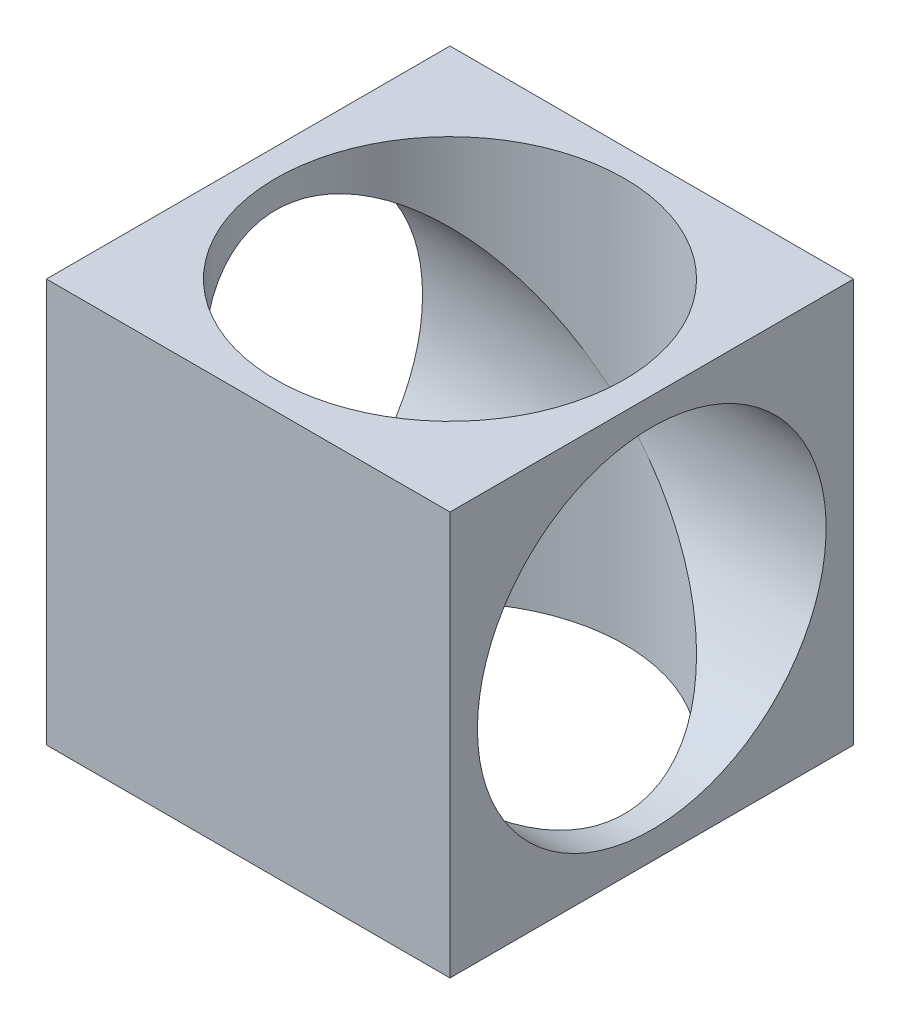
ISO-10303-21;
HEADER;
FILE_DESCRIPTION(('STEP AP214'),'2;1');
FILE_NAME('part.step','',(''),(''),'','','');
FILE_SCHEMA(('AUTOMOTIVE_DESIGN { 1 0 10303 214 1 1 1 1 }'));
ENDSEC;
DATA;
#1=APPLICATION_CONTEXT('core data for automotive mechanical design processes');
#2=APPLICATION_PROTOCOL_DEFINITION('international standard','automotive_design',2000,#1);
#3=PRODUCT_CONTEXT('',#1,'mechanical');
#4=PRODUCT('Part','Part','',(#3));
#5=PRODUCT_RELATED_PRODUCT_CATEGORY('part','',(#4));
#6=PRODUCT_DEFINITION_FORMATION('','',#4);
#7=PRODUCT_DEFINITION_CONTEXT('part definition',#1,'design');
#8=PRODUCT_DEFINITION('design','',#6,#7);
#9=PRODUCT_DEFINITION_SHAPE('','',#8);
#10=(LENGTH_UNIT() NAMED_UNIT(*) SI_UNIT(.MILLI.,.METRE.));
#11=(NAMED_UNIT(*) PLANE_ANGLE_UNIT() SI_UNIT($,.RADIAN.));
#12=(NAMED_UNIT(*) SI_UNIT($,.STERADIAN.) SOLID_ANGLE_UNIT());
#13=UNCERTAINTY_MEASURE_WITH_UNIT(LENGTH_MEASURE(1.E-05),#10,'distance_accuracy_value','');
#14=(GEOMETRIC_REPRESENTATION_CONTEXT(3) GLOBAL_UNCERTAINTY_ASSIGNED_CONTEXT((#13)) GLOBAL_UNIT_ASSIGNED_CONTEXT((#10,
#11,#12)) REPRESENTATION_CONTEXT('',''));
#15=CARTESIAN_POINT('',(0.,0.,0.));
#16=DIRECTION('',(0.,0.,1.));
#17=DIRECTION('',(1.,0.,0.));
#18=AXIS2_PLACEMENT_3D('',#15,#16,#17);
#19=CARTESIAN_POINT('',(0.,0.,0.));
#20=DIRECTION('',(0.,1.,0.));
#21=DIRECTION('',(0.,0.,1.));
#22=AXIS2_PLACEMENT_3D('',#19,#20,#21);
#23=CYLINDRICAL_SURFACE('',#22,13.716);
#24=CARTESIAN_POINT('',(0.,31.75,0.));
#25=DIRECTION('',(0.,-1.,0.));
#26=DIRECTION('',(0.,0.,-1.));
#27=AXIS2_PLACEMENT_3D('',#24,#25,#26);
#28=CIRCLE('',#27,13.716);
#29=CARTESIAN_POINT('',(0.,31.75,-13.716));
#30=VERTEX_POINT('',#29);
#31=EDGE_CURVE('E137',#30,#30,#28,.T.);
#32=ORIENTED_EDGE('',*,*,#31,.F.);
#33=EDGE_LOOP('',(#32));
#34=FACE_BOUND('',#33,.T.);
#35=CARTESIAN_POINT('',(0.,15.875,0.));
#36=DIRECTION('',(0.707106781186547,0.707106781186547,0.));
#37=DIRECTION('',(-0.707106781186547,0.707106781186547,0.));
#38=AXIS2_PLACEMENT_3D('',#35,#36,#37);
#39=ELLIPSE('',#38,19.3973532215094,13.716);
#40=CARTESIAN_POINT('',(0.,15.875,13.716));
#41=VERTEX_POINT('',#40);
#42=CARTESIAN_POINT('',(0.,15.875,-13.716));
#43=VERTEX_POINT('',#42);
#44=EDGE_CURVE('E52',#41,#43,#39,.F.);
#45=ORIENTED_EDGE('',*,*,#44,.T.);
#46=CARTESIAN_POINT('',(0.,15.875,0.));
#47=DIRECTION('',(-0.707106781186547,0.707106781186547,0.));
#48=DIRECTION('',(0.707106781186547,0.707106781186547,0.));
#49=AXIS2_PLACEMENT_3D('',#46,#47,#48);
#50=ELLIPSE('',#49,19.3973532215094,13.716);
#51=EDGE_CURVE('E11',#43,#41,#50,.F.);
#52=ORIENTED_EDGE('',*,*,#51,.T.);
#53=EDGE_LOOP('',(#45,#52));
#54=FACE_BOUND('',#53,.T.);
#55=ADVANCED_FACE('F38',(#34,#54),#23,.F.);
#56=CARTESIAN_POINT('',(15.875,31.75,15.875));
#57=DIRECTION('',(-1.,0.,0.));
#58=DIRECTION('',(0.,0.,1.));
#59=AXIS2_PLACEMENT_3D('',#56,#57,#58);
#60=PLANE('',#59);
#61=CARTESIAN_POINT('',(15.875,15.875,0.));
#62=DIRECTION('',(-1.,0.,0.));
#63=DIRECTION('',(0.,0.,1.));
#64=AXIS2_PLACEMENT_3D('',#61,#62,#63);
#65=CIRCLE('',#64,13.716);
#66=CARTESIAN_POINT('',(15.875,15.875,13.716));
#67=VERTEX_POINT('',#66);
#68=EDGE_CURVE('E158',#67,#67,#65,.T.);
#69=ORIENTED_EDGE('',*,*,#68,.T.);
#70=EDGE_LOOP('',(#69));
#71=FACE_BOUND('',#70,.T.);
#72=DIRECTION('',(0.,0.,-1.));
#73=VECTOR('',#72,1.);
#74=CARTESIAN_POINT('',(15.875,0.,15.875));
#75=LINE('',#74,#73);
#76=CARTESIAN_POINT('',(15.875,0.,15.875));
#77=VERTEX_POINT('',#76);
#78=CARTESIAN_POINT('',(15.875,0.,-15.875));
#79=VERTEX_POINT('',#78);
#80=EDGE_CURVE('E133',#77,#79,#75,.T.);
#81=ORIENTED_EDGE('',*,*,#80,.T.);
#82=DIRECTION('',(0.,-1.,0.));
#83=VECTOR('',#82,1.);
#84=CARTESIAN_POINT('',(15.875,31.75,-15.875));
#85=LINE('',#84,#83);
#86=CARTESIAN_POINT('',(15.875,31.75,-15.875));
#87=VERTEX_POINT('',#86);
#88=EDGE_CURVE('E106',#87,#79,#85,.T.);
#89=ORIENTED_EDGE('',*,*,#88,.F.);
#90=DIRECTION('',(0.,0.,-1.));
#91=VECTOR('',#90,1.);
#92=CARTESIAN_POINT('',(15.875,31.75,15.875));
#93=LINE('',#92,#91);
#94=CARTESIAN_POINT('',(15.875,31.75,15.875));
#95=VERTEX_POINT('',#94);
#96=EDGE_CURVE('E126',#95,#87,#93,.T.);
#97=ORIENTED_EDGE('',*,*,#96,.F.);
#98=DIRECTION('',(0.,-1.,0.));
#99=VECTOR('',#98,1.);
#100=CARTESIAN_POINT('',(15.875,31.75,15.875));
#101=LINE('',#100,#99);
#102=EDGE_CURVE('E121',#95,#77,#101,.T.);
#103=ORIENTED_EDGE('',*,*,#102,.T.);
#104=EDGE_LOOP('',(#81,#89,#97,#103));
#105=FACE_BOUND('',#104,.T.);
#106=ADVANCED_FACE('F40',(#71,#105),#60,.F.);
#107=CARTESIAN_POINT('',(-15.875,31.75,-15.875));
#108=DIRECTION('',(0.,0.,1.));
#109=DIRECTION('',(1.,0.,0.));
#110=AXIS2_PLACEMENT_3D('',#107,#108,#109);
#111=PLANE('',#110);
#112=DIRECTION('',(-1.,0.,0.));
#113=VECTOR('',#112,1.);
#114=CARTESIAN_POINT('',(-15.875,0.,-15.875));
#115=LINE('',#114,#113);
#116=CARTESIAN_POINT('',(-15.875,0.,-15.875));
#117=VERTEX_POINT('',#116);
#118=EDGE_CURVE('E130',#79,#117,#115,.T.);
#119=ORIENTED_EDGE('',*,*,#118,.T.);
#120=DIRECTION('',(0.,-1.,0.));
#121=VECTOR('',#120,1.);
#122=CARTESIAN_POINT('',(-15.875,31.75,-15.875));
#123=LINE('',#122,#121);
#124=CARTESIAN_POINT('',(-15.875,31.75,-15.875));
#125=VERTEX_POINT('',#124);
#126=EDGE_CURVE('E114',#125,#117,#123,.T.);
#127=ORIENTED_EDGE('',*,*,#126,.F.);
#128=DIRECTION('',(-1.,0.,0.));
#129=VECTOR('',#128,1.);
#130=CARTESIAN_POINT('',(-15.875,31.75,-15.875));
#131=LINE('',#130,#129);
#132=EDGE_CURVE('E90',#87,#125,#131,.T.);
#133=ORIENTED_EDGE('',*,*,#132,.F.);
#134=ORIENTED_EDGE('',*,*,#88,.T.);
#135=EDGE_LOOP('',(#119,#127,#133,#134));
#136=FACE_BOUND('',#135,.T.);
#137=ADVANCED_FACE('F178',(#136),#111,.F.);
#138=CARTESIAN_POINT('',(-15.875,31.75,15.875));
#139=DIRECTION('',(1.,0.,0.));
#140=DIRECTION('',(0.,0.,-1.));
#141=AXIS2_PLACEMENT_3D('',#138,#139,#140);
#142=PLANE('',#141);
#143=CARTESIAN_POINT('',(-15.875,15.875,0.));
#144=DIRECTION('',(1.,0.,0.));
#145=DIRECTION('',(0.,0.,-1.));
#146=AXIS2_PLACEMENT_3D('',#143,#144,#145);
#147=CIRCLE('',#146,13.716);
#148=CARTESIAN_POINT('',(-15.875,15.875,-13.716));
#149=VERTEX_POINT('',#148);
#150=EDGE_CURVE('E154',#149,#149,#147,.T.);
#151=ORIENTED_EDGE('',*,*,#150,.T.);
#152=EDGE_LOOP('',(#151));
#153=FACE_BOUND('',#152,.T.);
#154=DIRECTION('',(0.,0.,1.));
#155=VECTOR('',#154,1.);
#156=CARTESIAN_POINT('',(-15.875,0.,15.875));
#157=LINE('',#156,#155);
#158=CARTESIAN_POINT('',(-15.875,0.,15.875));
#159=VERTEX_POINT('',#158);
#160=EDGE_CURVE('E127',#117,#159,#157,.T.);
#161=ORIENTED_EDGE('',*,*,#160,.T.);
#162=DIRECTION('',(0.,-1.,0.));
#163=VECTOR('',#162,1.);
#164=CARTESIAN_POINT('',(-15.875,31.75,15.875));
#165=LINE('',#164,#163);
#166=CARTESIAN_POINT('',(-15.875,31.75,15.875));
#167=VERTEX_POINT('',#166);
#168=EDGE_CURVE('E118',#167,#159,#165,.T.);
#169=ORIENTED_EDGE('',*,*,#168,.F.);
#170=DIRECTION('',(0.,0.,1.));
#171=VECTOR('',#170,1.);
#172=CARTESIAN_POINT('',(-15.875,31.75,15.875));
#173=LINE('',#172,#171);
#174=EDGE_CURVE('E140',#125,#167,#173,.T.);
#175=ORIENTED_EDGE('',*,*,#174,.F.);
#176=ORIENTED_EDGE('',*,*,#126,.T.);
#177=EDGE_LOOP('',(#161,#169,#175,#176));
#178=FACE_BOUND('',#177,.T.);
#179=ADVANCED_FACE('F196',(#153,#178),#142,.F.);
#180=CARTESIAN_POINT('',(-15.875,31.75,15.875));
#181=DIRECTION('',(0.,0.,-1.));
#182=DIRECTION('',(-1.,0.,0.));
#183=AXIS2_PLACEMENT_3D('',#180,#181,#182);
#184=PLANE('',#183);
#185=DIRECTION('',(1.,0.,0.));
#186=VECTOR('',#185,1.);
#187=CARTESIAN_POINT('',(-15.875,0.,15.875));
#188=LINE('',#187,#186);
#189=EDGE_CURVE('E82',#159,#77,#188,.T.);
#190=ORIENTED_EDGE('',*,*,#189,.T.);
#191=ORIENTED_EDGE('',*,*,#102,.F.);
#192=DIRECTION('',(1.,0.,0.));
#193=VECTOR('',#192,1.);
#194=CARTESIAN_POINT('',(-15.875,31.75,15.875));
#195=LINE('',#194,#193);
#196=EDGE_CURVE('E61',#167,#95,#195,.T.);
#197=ORIENTED_EDGE('',*,*,#196,.F.);
#198=ORIENTED_EDGE('',*,*,#168,.T.);
#199=EDGE_LOOP('',(#190,#191,#197,#198));
#200=FACE_BOUND('',#199,.T.);
#201=ADVANCED_FACE('F190',(#200),#184,.F.);
#202=CARTESIAN_POINT('',(0.,31.75,0.));
#203=DIRECTION('',(0.,-1.,0.));
#204=DIRECTION('',(0.,0.,-1.));
#205=AXIS2_PLACEMENT_3D('',#202,#203,#204);
#206=PLANE('',#205);
#207=ORIENTED_EDGE('',*,*,#31,.T.);
#208=EDGE_LOOP('',(#207));
#209=FACE_BOUND('',#208,.T.);
#210=ORIENTED_EDGE('',*,*,#96,.T.);
#211=ORIENTED_EDGE('',*,*,#132,.T.);
#212=ORIENTED_EDGE('',*,*,#174,.T.);
#213=ORIENTED_EDGE('',*,*,#196,.T.);
#214=EDGE_LOOP('',(#210,#211,#212,#213));
#215=FACE_BOUND('',#214,.T.);
#216=ADVANCED_FACE('F185',(#209,#215),#206,.F.);
#217=CARTESIAN_POINT('',(0.,0.,0.));
#218=DIRECTION('',(0.,-1.,0.));
#219=DIRECTION('',(0.,0.,-1.));
#220=AXIS2_PLACEMENT_3D('',#217,#218,#219);
#221=PLANE('',#220);
#222=CARTESIAN_POINT('',(0.,0.,0.));
#223=DIRECTION('',(0.,1.,0.));
#224=DIRECTION('',(0.,0.,1.));
#225=AXIS2_PLACEMENT_3D('',#222,#223,#224);
#226=CIRCLE('',#225,13.716);
#227=CARTESIAN_POINT('',(0.,0.,13.716));
#228=VERTEX_POINT('',#227);
#229=EDGE_CURVE('E150',#228,#228,#226,.T.);
#230=ORIENTED_EDGE('',*,*,#229,.T.);
#231=EDGE_LOOP('',(#230));
#232=FACE_BOUND('',#231,.T.);
#233=ORIENTED_EDGE('',*,*,#80,.F.);
#234=ORIENTED_EDGE('',*,*,#189,.F.);
#235=ORIENTED_EDGE('',*,*,#160,.F.);
#236=ORIENTED_EDGE('',*,*,#118,.F.);
#237=EDGE_LOOP('',(#233,#234,#235,#236));
#238=FACE_BOUND('',#237,.T.);
#239=ADVANCED_FACE('F181',(#232,#238),#221,.T.);
#240=CARTESIAN_POINT('',(0.,15.875,0.));
#241=DIRECTION('',(0.707106781186547,0.707106781186547,0.));
#242=DIRECTION('',(-0.707106781186547,0.707106781186547,0.));
#243=AXIS2_PLACEMENT_3D('',#240,#241,#242);
#244=ELLIPSE('',#243,19.3973532215094,13.716);
#245=EDGE_CURVE('E96',#41,#43,#244,.T.);
#246=ORIENTED_EDGE('',*,*,#245,.T.);
#247=CARTESIAN_POINT('',(0.,15.875,0.));
#248=DIRECTION('',(-0.707106781186547,0.707106781186547,0.));
#249=DIRECTION('',(0.707106781186547,0.707106781186547,0.));
#250=AXIS2_PLACEMENT_3D('',#247,#248,#249);
#251=ELLIPSE('',#250,19.3973532215094,13.716);
#252=EDGE_CURVE('E47',#43,#41,#251,.T.);
#253=ORIENTED_EDGE('',*,*,#252,.T.);
#254=EDGE_LOOP('',(#246,#253));
#255=FACE_BOUND('',#254,.T.);
#256=ORIENTED_EDGE('',*,*,#229,.F.);
#257=EDGE_LOOP('',(#256));
#258=FACE_BOUND('',#257,.T.);
#259=ADVANCED_FACE('F108',(#255,#258),#23,.F.);
#260=CARTESIAN_POINT('',(15.875,15.875,0.));
#261=DIRECTION('',(-1.,0.,0.));
#262=DIRECTION('',(0.,0.,1.));
#263=AXIS2_PLACEMENT_3D('',#260,#261,#262);
#264=CYLINDRICAL_SURFACE('',#263,13.716);
#265=ORIENTED_EDGE('',*,*,#44,.F.);
#266=ORIENTED_EDGE('',*,*,#252,.F.);
#267=EDGE_LOOP('',(#265,#266));
#268=FACE_BOUND('',#267,.T.);
#269=ORIENTED_EDGE('',*,*,#150,.F.);
#270=EDGE_LOOP('',(#269));
#271=FACE_BOUND('',#270,.T.);
#272=ADVANCED_FACE('F103',(#268,#271),#264,.F.);
#273=ORIENTED_EDGE('',*,*,#68,.F.);
#274=EDGE_LOOP('',(#273));
#275=FACE_BOUND('',#274,.T.);
#276=ORIENTED_EDGE('',*,*,#245,.F.);
#277=ORIENTED_EDGE('',*,*,#51,.F.);
#278=EDGE_LOOP('',(#276,#277));
#279=FACE_BOUND('',#278,.T.);
#280=ADVANCED_FACE('F97',(#275,#279),#264,.F.);
#281=CLOSED_SHELL('',(#55,#106,#137,#179,#201,#216,#239,#259,#272,#280));
#282=MANIFOLD_SOLID_BREP('B2',#281);
#283=ADVANCED_BREP_SHAPE_REPRESENTATION('',(#18,#282),#14);
#284=SHAPE_DEFINITION_REPRESENTATION(#9,#283);
ENDSEC;
END-ISO-10303-21;
